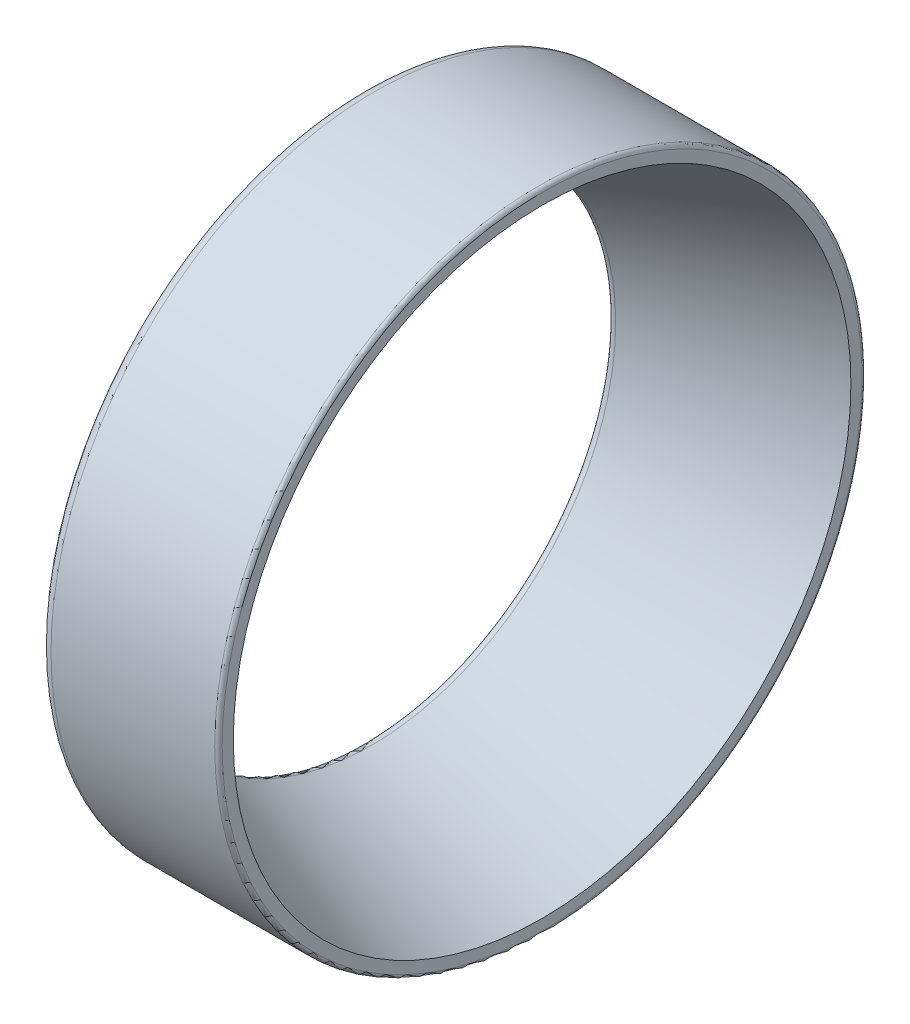
ISO-10303-21;
HEADER;
FILE_DESCRIPTION(('STEP AP214'),'2;1');
FILE_NAME('part.step','',(''),(''),'','','');
FILE_SCHEMA(('AUTOMOTIVE_DESIGN { 1 0 10303 214 1 1 1 1 }'));
ENDSEC;
DATA;
#1=APPLICATION_CONTEXT('core data for automotive mechanical design processes');
#2=APPLICATION_PROTOCOL_DEFINITION('international standard','automotive_design',2000,#1);
#3=PRODUCT_CONTEXT('',#1,'mechanical');
#4=PRODUCT('Part','Part','',(#3));
#5=PRODUCT_RELATED_PRODUCT_CATEGORY('part','',(#4));
#6=PRODUCT_DEFINITION_FORMATION('','',#4);
#7=PRODUCT_DEFINITION_CONTEXT('part definition',#1,'design');
#8=PRODUCT_DEFINITION('design','',#6,#7);
#9=PRODUCT_DEFINITION_SHAPE('','',#8);
#10=(LENGTH_UNIT() NAMED_UNIT(*) SI_UNIT(.MILLI.,.METRE.));
#11=(NAMED_UNIT(*) PLANE_ANGLE_UNIT() SI_UNIT($,.RADIAN.));
#12=(NAMED_UNIT(*) SI_UNIT($,.STERADIAN.) SOLID_ANGLE_UNIT());
#13=UNCERTAINTY_MEASURE_WITH_UNIT(LENGTH_MEASURE(1.E-05),#10,'distance_accuracy_value','');
#14=(GEOMETRIC_REPRESENTATION_CONTEXT(3) GLOBAL_UNCERTAINTY_ASSIGNED_CONTEXT((#13)) GLOBAL_UNIT_ASSIGNED_CONTEXT((#10,
#11,#12)) REPRESENTATION_CONTEXT('',''));
#15=CARTESIAN_POINT('',(0.,0.,0.));
#16=DIRECTION('',(0.,0.,1.));
#17=DIRECTION('',(1.,0.,0.));
#18=AXIS2_PLACEMENT_3D('',#15,#16,#17);
#19=CARTESIAN_POINT('',(0.,-28.520137624798,-28.));
#20=DIRECTION('',(-1.,0.,0.));
#21=DIRECTION('',(0.,0.,1.));
#22=AXIS2_PLACEMENT_3D('',#19,#20,#21);
#23=PLANE('',#22);
#24=CARTESIAN_POINT('',(0.,0.,0.));
#25=DIRECTION('',(-1.,0.,0.));
#26=DIRECTION('',(0.,0.,-1.));
#27=AXIS2_PLACEMENT_3D('',#24,#25,#26);
#28=CIRCLE('',#27,28.0000000258104);
#29=CARTESIAN_POINT('',(0.,0.,-28.0000000258104));
#30=VERTEX_POINT('',#29);
#31=EDGE_CURVE('E41',#30,#30,#28,.F.);
#32=ORIENTED_EDGE('',*,*,#31,.F.);
#33=EDGE_LOOP('',(#32));
#34=FACE_BOUND('',#33,.T.);
#35=CARTESIAN_POINT('',(0.,0.,0.));
#36=DIRECTION('',(1.,0.,0.));
#37=DIRECTION('',(0.,-1.16841900243311E-09,1.));
#38=AXIS2_PLACEMENT_3D('',#35,#36,#37);
#39=CIRCLE('',#38,22.387907659466);
#40=CARTESIAN_POINT('',(0.,-2.61584567340378E-08,22.387907659466));
#41=VERTEX_POINT('',#40);
#42=EDGE_CURVE('E38',#41,#41,#39,.T.);
#43=ORIENTED_EDGE('',*,*,#42,.T.);
#44=EDGE_LOOP('',(#43));
#45=FACE_BOUND('',#44,.T.);
#46=ADVANCED_FACE('F15',(#34,#45),#23,.T.);
#47=CARTESIAN_POINT('',(16.,-29.1991884707575,28.666666666667));
#48=DIRECTION('',(1.,0.,0.));
#49=DIRECTION('',(0.,0.,-1.));
#50=AXIS2_PLACEMENT_3D('',#47,#48,#49);
#51=PLANE('',#50);
#52=CARTESIAN_POINT('',(16.,0.,0.));
#53=DIRECTION('',(1.,0.,0.));
#54=DIRECTION('',(0.,-1.16839933077486E-09,1.));
#55=AXIS2_PLACEMENT_3D('',#52,#53,#54);
#56=CIRCLE('',#55,28.6666667370862);
#57=CARTESIAN_POINT('',(16.,-3.34941142311576E-08,28.6666667370862));
#58=VERTEX_POINT('',#57);
#59=EDGE_CURVE('E35',#58,#58,#56,.T.);
#60=ORIENTED_EDGE('',*,*,#59,.T.);
#61=EDGE_LOOP('',(#60));
#62=FACE_BOUND('',#61,.T.);
#63=CARTESIAN_POINT('',(16.,0.,0.));
#64=DIRECTION('',(-1.,0.,0.));
#65=DIRECTION('',(0.,0.,-1.));
#66=AXIS2_PLACEMENT_3D('',#63,#64,#65);
#67=CIRCLE('',#66,27.669749671069);
#68=CARTESIAN_POINT('',(16.,0.,-27.669749671069));
#69=VERTEX_POINT('',#68);
#70=EDGE_CURVE('E30',#69,#69,#67,.F.);
#71=ORIENTED_EDGE('',*,*,#70,.F.);
#72=EDGE_LOOP('',(#71));
#73=FACE_BOUND('',#72,.T.);
#74=ADVANCED_FACE('F49',(#62,#73),#51,.T.);
#75=CARTESIAN_POINT('',(0.499999999999551,0.,0.));
#76=DIRECTION('',(1.,0.,0.));
#77=DIRECTION('',(0.,0.,1.));
#78=AXIS2_PLACEMENT_3D('',#75,#76,#77);
#79=TOROIDAL_SURFACE('',#78,22.3879076594658,0.499999999999551);
#80=ORIENTED_EDGE('',*,*,#42,.F.);
#81=EDGE_LOOP('',(#80));
#82=FACE_BOUND('',#81,.T.);
#83=CARTESIAN_POINT('',(0.675651229243546,0.,0.));
#84=DIRECTION('',(1.,0.,0.));
#85=DIRECTION('',(0.,0.,1.));
#86=AXIS2_PLACEMENT_3D('',#83,#84,#85);
#87=CIRCLE('',#86,21.919776646111);
#88=CARTESIAN_POINT('',(0.675651229243546,0.,21.919776646111));
#89=VERTEX_POINT('',#88);
#90=EDGE_CURVE('E26',#89,#89,#87,.T.);
#91=ORIENTED_EDGE('',*,*,#90,.T.);
#92=EDGE_LOOP('',(#91));
#93=FACE_BOUND('',#92,.T.);
#94=ADVANCED_FACE('F53',(#82,#93),#79,.T.);
#95=CARTESIAN_POINT('',(16.,0.,0.));
#96=DIRECTION('',(1.,0.,0.));
#97=DIRECTION('',(0.,0.,1.));
#98=AXIS2_PLACEMENT_3D('',#95,#96,#97);
#99=CONICAL_SURFACE('',#98,27.669749671069,0.358961867257672);
#100=ORIENTED_EDGE('',*,*,#70,.T.);
#101=EDGE_LOOP('',(#100));
#102=FACE_BOUND('',#101,.T.);
#103=ORIENTED_EDGE('',*,*,#90,.F.);
#104=EDGE_LOOP('',(#103));
#105=FACE_BOUND('',#104,.T.);
#106=ADVANCED_FACE('F56',(#102,#105),#99,.F.);
#107=CARTESIAN_POINT('',(15.6666666666661,0.,0.));
#108=DIRECTION('',(1.,0.,0.));
#109=DIRECTION('',(0.,0.,1.));
#110=AXIS2_PLACEMENT_3D('',#107,#108,#109);
#111=TOROIDAL_SURFACE('',#110,28.666666666666,0.333333333333956);
#112=CARTESIAN_POINT('',(15.6666666666661,0.,0.));
#113=DIRECTION('',(1.,0.,0.));
#114=DIRECTION('',(0.,0.,1.));
#115=AXIS2_PLACEMENT_3D('',#112,#113,#114);
#116=CIRCLE('',#115,29.);
#117=CARTESIAN_POINT('',(15.6666666666661,0.,29.));
#118=VERTEX_POINT('',#117);
#119=EDGE_CURVE('E22',#118,#118,#116,.T.);
#120=ORIENTED_EDGE('',*,*,#119,.T.);
#121=EDGE_LOOP('',(#120));
#122=FACE_BOUND('',#121,.T.);
#123=ORIENTED_EDGE('',*,*,#59,.F.);
#124=EDGE_LOOP('',(#123));
#125=FACE_BOUND('',#124,.T.);
#126=ADVANCED_FACE('F61',(#122,#125),#111,.T.);
#127=CARTESIAN_POINT('',(16.,0.,0.));
#128=DIRECTION('',(1.,0.,0.));
#129=DIRECTION('',(0.,0.,1.));
#130=AXIS2_PLACEMENT_3D('',#127,#128,#129);
#131=CYLINDRICAL_SURFACE('',#130,29.);
#132=CARTESIAN_POINT('',(1.,0.,0.));
#133=DIRECTION('',(1.,0.,0.));
#134=DIRECTION('',(0.,0.,1.));
#135=AXIS2_PLACEMENT_3D('',#132,#133,#134);
#136=CIRCLE('',#135,29.);
#137=CARTESIAN_POINT('',(1.,0.,29.));
#138=VERTEX_POINT('',#137);
#139=EDGE_CURVE('E10',#138,#138,#136,.T.);
#140=ORIENTED_EDGE('',*,*,#139,.T.);
#141=EDGE_LOOP('',(#140));
#142=FACE_BOUND('',#141,.T.);
#143=ORIENTED_EDGE('',*,*,#119,.F.);
#144=EDGE_LOOP('',(#143));
#145=FACE_BOUND('',#144,.T.);
#146=ADVANCED_FACE('F68',(#142,#145),#131,.T.);
#147=CARTESIAN_POINT('',(0.999999999999226,0.,0.));
#148=DIRECTION('',(1.,0.,0.));
#149=DIRECTION('',(0.,0.,1.));
#150=AXIS2_PLACEMENT_3D('',#147,#148,#149);
#151=TOROIDAL_SURFACE('',#150,28.0000000000008,0.999999999999227);
#152=ORIENTED_EDGE('',*,*,#31,.T.);
#153=EDGE_LOOP('',(#152));
#154=FACE_BOUND('',#153,.T.);
#155=ORIENTED_EDGE('',*,*,#139,.F.);
#156=EDGE_LOOP('',(#155));
#157=FACE_BOUND('',#156,.T.);
#158=ADVANCED_FACE('F17',(#154,#157),#151,.T.);
#159=CLOSED_SHELL('',(#46,#74,#94,#106,#126,#146,#158));
#160=MANIFOLD_SOLID_BREP('B1',#159);
#161=ADVANCED_BREP_SHAPE_REPRESENTATION('',(#18,#160),#14);
#162=SHAPE_DEFINITION_REPRESENTATION(#9,#161);
ENDSEC;
END-ISO-10303-21;
